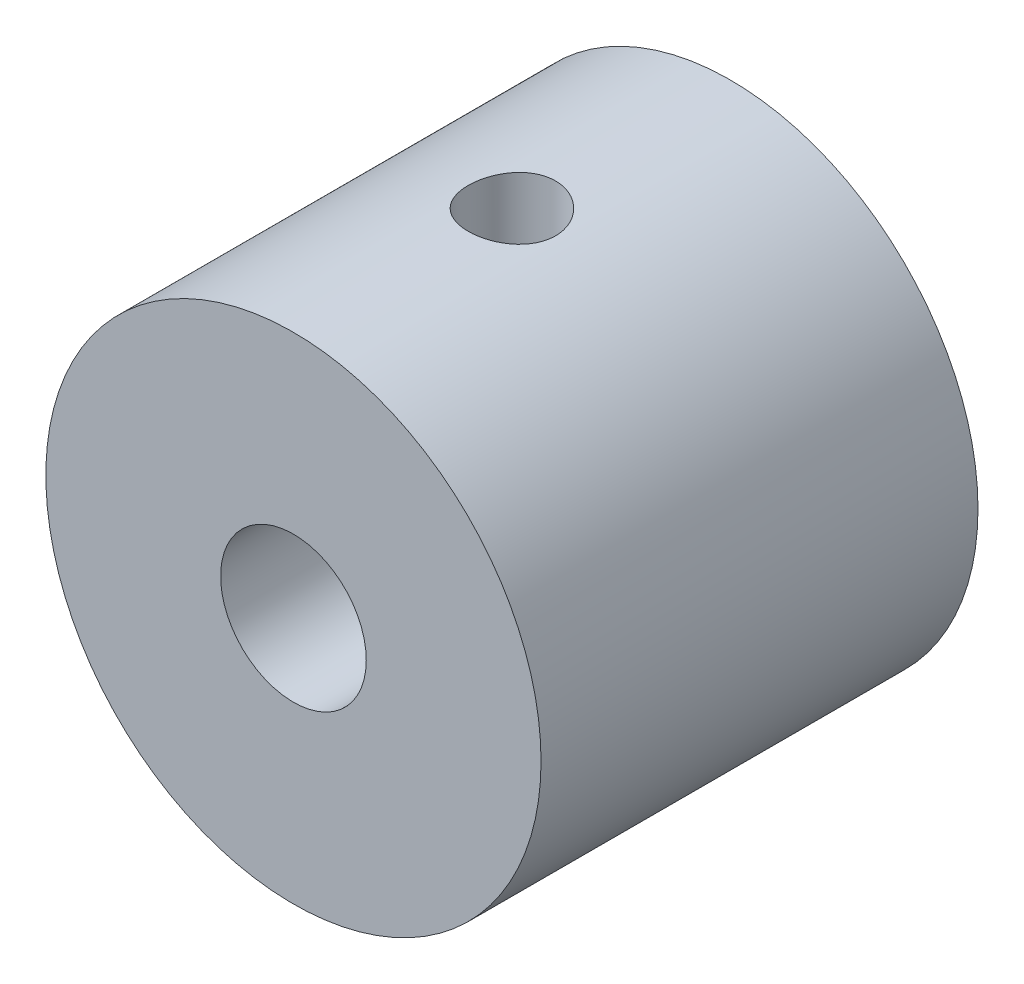
ISO-10303-21;
HEADER;
FILE_DESCRIPTION(('STEP AP214'),'2;1');
FILE_NAME('part.step','',(''),(''),'','','');
FILE_SCHEMA(('AUTOMOTIVE_DESIGN { 1 0 10303 214 1 1 1 1 }'));
ENDSEC;
DATA;
#1=APPLICATION_CONTEXT('core data for automotive mechanical design processes');
#2=APPLICATION_PROTOCOL_DEFINITION('international standard','automotive_design',2000,#1);
#3=PRODUCT_CONTEXT('',#1,'mechanical');
#4=PRODUCT('Part','Part','',(#3));
#5=PRODUCT_RELATED_PRODUCT_CATEGORY('part','',(#4));
#6=PRODUCT_DEFINITION_FORMATION('','',#4);
#7=PRODUCT_DEFINITION_CONTEXT('part definition',#1,'design');
#8=PRODUCT_DEFINITION('design','',#6,#7);
#9=PRODUCT_DEFINITION_SHAPE('','',#8);
#10=(LENGTH_UNIT() NAMED_UNIT(*) SI_UNIT(.MILLI.,.METRE.));
#11=(NAMED_UNIT(*) PLANE_ANGLE_UNIT() SI_UNIT($,.RADIAN.));
#12=(NAMED_UNIT(*) SI_UNIT($,.STERADIAN.) SOLID_ANGLE_UNIT());
#13=UNCERTAINTY_MEASURE_WITH_UNIT(LENGTH_MEASURE(1.E-05),#10,'distance_accuracy_value','');
#14=(GEOMETRIC_REPRESENTATION_CONTEXT(3) GLOBAL_UNCERTAINTY_ASSIGNED_CONTEXT((#13)) GLOBAL_UNIT_ASSIGNED_CONTEXT((#10,
#11,#12)) REPRESENTATION_CONTEXT('',''));
#15=CARTESIAN_POINT('',(0.,0.,0.));
#16=DIRECTION('',(0.,0.,1.));
#17=DIRECTION('',(1.,0.,0.));
#18=AXIS2_PLACEMENT_3D('',#15,#16,#17);
#19=CARTESIAN_POINT('',(0.,0.,15.));
#20=DIRECTION('',(0.,0.,1.));
#21=DIRECTION('',(1.,0.,0.));
#22=AXIS2_PLACEMENT_3D('',#19,#20,#21);
#23=PLANE('',#22);
#24=CARTESIAN_POINT('',(0.,0.,15.));
#25=DIRECTION('',(0.,0.,1.));
#26=DIRECTION('',(1.,0.,0.));
#27=AXIS2_PLACEMENT_3D('',#24,#25,#26);
#28=CIRCLE('',#27,8.5);
#29=CARTESIAN_POINT('',(8.5,0.,15.));
#30=VERTEX_POINT('',#29);
#31=EDGE_CURVE('E10',#30,#30,#28,.T.);
#32=ORIENTED_EDGE('',*,*,#31,.T.);
#33=EDGE_LOOP('',(#32));
#34=FACE_BOUND('',#33,.T.);
#35=CARTESIAN_POINT('',(0.,0.,15.));
#36=DIRECTION('',(0.,0.,1.));
#37=DIRECTION('',(1.,0.,0.));
#38=AXIS2_PLACEMENT_3D('',#35,#36,#37);
#39=CIRCLE('',#38,2.5);
#40=CARTESIAN_POINT('',(2.5,0.,15.));
#41=VERTEX_POINT('',#40);
#42=EDGE_CURVE('E50',#41,#41,#39,.T.);
#43=ORIENTED_EDGE('',*,*,#42,.F.);
#44=EDGE_LOOP('',(#43));
#45=FACE_BOUND('',#44,.T.);
#46=ADVANCED_FACE('F31',(#34,#45),#23,.T.);
#47=CARTESIAN_POINT('',(0.,0.,0.));
#48=DIRECTION('',(0.,0.,1.));
#49=DIRECTION('',(1.,0.,0.));
#50=AXIS2_PLACEMENT_3D('',#47,#48,#49);
#51=PLANE('',#50);
#52=CARTESIAN_POINT('',(0.,0.,0.));
#53=DIRECTION('',(0.,0.,1.));
#54=DIRECTION('',(1.,0.,0.));
#55=AXIS2_PLACEMENT_3D('',#52,#53,#54);
#56=CIRCLE('',#55,8.5);
#57=CARTESIAN_POINT('',(8.5,0.,0.));
#58=VERTEX_POINT('',#57);
#59=EDGE_CURVE('E45',#58,#58,#56,.T.);
#60=ORIENTED_EDGE('',*,*,#59,.F.);
#61=EDGE_LOOP('',(#60));
#62=FACE_BOUND('',#61,.T.);
#63=CARTESIAN_POINT('',(0.,0.,0.));
#64=DIRECTION('',(0.,0.,1.));
#65=DIRECTION('',(1.,0.,0.));
#66=AXIS2_PLACEMENT_3D('',#63,#64,#65);
#67=CIRCLE('',#66,2.5);
#68=CARTESIAN_POINT('',(2.5,0.,0.));
#69=VERTEX_POINT('',#68);
#70=EDGE_CURVE('E53',#69,#69,#67,.T.);
#71=ORIENTED_EDGE('',*,*,#70,.T.);
#72=EDGE_LOOP('',(#71));
#73=FACE_BOUND('',#72,.T.);
#74=ADVANCED_FACE('F89',(#62,#73),#51,.F.);
#75=CARTESIAN_POINT('',(0.,0.,15.));
#76=DIRECTION('',(0.,0.,-1.));
#77=DIRECTION('',(-1.,0.,0.));
#78=AXIS2_PLACEMENT_3D('',#75,#76,#77);
#79=CYLINDRICAL_SURFACE('',#78,8.5);
#80=CARTESIAN_POINT('',(0.,-8.5,9.));
#81=CARTESIAN_POINT('',(0.0835602073116834,-8.49999852465812,8.9999967178691));
#82=CARTESIAN_POINT('',(0.167164170899166,-8.49875504437695,8.99299410009958));
#83=CARTESIAN_POINT('',(0.33202220467292,-8.49391434547826,8.96518320685825));
#84=CARTESIAN_POINT('',(0.413274128543538,-8.49031504366607,8.94436271235211));
#85=CARTESIAN_POINT('',(0.571019510053261,-8.4811659180518,8.88956848670668));
#86=CARTESIAN_POINT('',(0.647516980962108,-8.47561776634704,8.85560602873436));
#87=CARTESIAN_POINT('',(0.79371930055972,-8.4631790616307,8.77552262272467));
#88=CARTESIAN_POINT('',(0.863424820850616,-8.45628864154791,8.72940287849939));
#89=CARTESIAN_POINT('',(0.994816516549547,-8.44184556474541,8.62579132915275));
#90=CARTESIAN_POINT('',(1.05641975336287,-8.43428721228608,8.56819513097525));
#91=CARTESIAN_POINT('',(1.1691412650637,-8.41940313016037,8.44349027020934));
#92=CARTESIAN_POINT('',(1.22025883768728,-8.4120774161024,8.37638097100183));
#93=CARTESIAN_POINT('',(1.31089615224234,-8.39843282674879,8.23397760532877));
#94=CARTESIAN_POINT('',(1.35033279728854,-8.39212130489153,8.15862988281188));
#95=CARTESIAN_POINT('',(1.41595715270317,-8.38129933378098,8.0022490569533));
#96=CARTESIAN_POINT('',(1.44214587005801,-8.37678874764249,7.92121638626272));
#97=CARTESIAN_POINT('',(1.48026740658905,-8.37013636121934,7.75664894310292));
#98=CARTESIAN_POINT('',(1.49234409471487,-8.36797067223513,7.67314848174711));
#99=CARTESIAN_POINT('',(1.50234505486158,-8.36618114129228,7.50528048894824));
#100=CARTESIAN_POINT('',(1.50027044993802,-8.36655709762705,7.42091302684148));
#101=CARTESIAN_POINT('',(1.48214465879202,-8.36978659532625,7.25473986745596));
#102=CARTESIAN_POINT('',(1.46625598617925,-8.37261132730482,7.17291580162267));
#103=CARTESIAN_POINT('',(1.42120852873224,-8.38037493445764,7.01311326819002));
#104=CARTESIAN_POINT('',(1.39204923880641,-8.38531389010072,6.93513494708836));
#105=CARTESIAN_POINT('',(1.32112618145376,-8.39678011228507,6.78475593979735));
#106=CARTESIAN_POINT('',(1.27929578300233,-8.40331573888177,6.71238734241572));
#107=CARTESIAN_POINT('',(1.18426514162452,-8.41723322878403,6.575634979316));
#108=CARTESIAN_POINT('',(1.13106387280683,-8.42461516841691,6.5112519348913));
#109=CARTESIAN_POINT('',(1.01392044402847,-8.43951963661095,6.39135835341984));
#110=CARTESIAN_POINT('',(0.949839043227183,-8.44704269154381,6.33598383870425));
#111=CARTESIAN_POINT('',(0.813223017047742,-8.46128697681384,6.23675182224636));
#112=CARTESIAN_POINT('',(0.74068832425797,-8.46800820075587,6.19289441235744));
#113=CARTESIAN_POINT('',(0.58909043349764,-8.47990283414647,6.11792570133133));
#114=CARTESIAN_POINT('',(0.510020681297825,-8.48507466502145,6.08682738775337));
#115=CARTESIAN_POINT('',(0.347668482380528,-8.49327535201155,6.03839100335811));
#116=CARTESIAN_POINT('',(0.264386432134316,-8.49630440940878,6.02105164007075));
#117=CARTESIAN_POINT('',(0.0971451116191689,-8.49985092576813,6.00081200141636));
#118=CARTESIAN_POINT('',(0.013209084361507,-8.50040083433622,5.99772516159403));
#119=CARTESIAN_POINT('',(-0.153980271251543,-8.49901631664242,6.00557941294352));
#120=CARTESIAN_POINT('',(-0.237233629020516,-8.49708199798832,6.01651989650209));
#121=CARTESIAN_POINT('',(-0.400111048540306,-8.49096650695861,6.05196307734012));
#122=CARTESIAN_POINT('',(-0.479756042957809,-8.48680079660993,6.07637247882884));
#123=CARTESIAN_POINT('',(-0.633823333081784,-8.47668767054273,6.13796046041181));
#124=CARTESIAN_POINT('',(-0.708245306379776,-8.47074014495488,6.17513982794151));
#125=CARTESIAN_POINT('',(-0.850557919353285,-8.45764232694309,6.2616330721365));
#126=CARTESIAN_POINT('',(-0.918377380876573,-8.45048081539685,6.31106232996766));
#127=CARTESIAN_POINT('',(-1.04482575376698,-8.43578086254215,6.42049471234006));
#128=CARTESIAN_POINT('',(-1.10345391044434,-8.42824239034875,6.48049870430486));
#129=CARTESIAN_POINT('',(-1.21055495751759,-8.41353196779635,6.61021768885172));
#130=CARTESIAN_POINT('',(-1.25890120329949,-8.40636532837837,6.68003794375939));
#131=CARTESIAN_POINT('',(-1.34317887649159,-8.39331262284436,6.82691843383291));
#132=CARTESIAN_POINT('',(-1.37911073038509,-8.38742651273966,6.90397842016974));
#133=CARTESIAN_POINT('',(-1.43735470236499,-8.37764200573802,7.06281171816086));
#134=CARTESIAN_POINT('',(-1.45972757437841,-8.3737347552807,7.14456218099255));
#135=CARTESIAN_POINT('',(-1.49040804698522,-8.36832903130758,7.31073623477485));
#136=CARTESIAN_POINT('',(-1.4987170345307,-8.36683032026719,7.39515956129642));
#137=CARTESIAN_POINT('',(-1.50099164151106,-8.36642243845549,7.5630165247977));
#138=CARTESIAN_POINT('',(-1.49515678461176,-8.36747724556747,7.64644743680322));
#139=CARTESIAN_POINT('',(-1.46974322873663,-8.37197817944576,7.81111994714207));
#140=CARTESIAN_POINT('',(-1.45016459057914,-8.37542429563017,7.89236155516174));
#141=CARTESIAN_POINT('',(-1.39789926667029,-8.38430518558531,8.05025834545232));
#142=CARTESIAN_POINT('',(-1.36523178909751,-8.38973704421377,8.12692006020943));
#143=CARTESIAN_POINT('',(-1.2877371522897,-8.40197983656061,8.27370686948198));
#144=CARTESIAN_POINT('',(-1.24290927156669,-8.40879085209956,8.34383157581883));
#145=CARTESIAN_POINT('',(-1.1416626166475,-8.42313765215559,8.47655797659853));
#146=CARTESIAN_POINT('',(-1.0850977566265,-8.43068186379938,8.53904734012171));
#147=CARTESIAN_POINT('',(-0.962289483399126,-8.44557973306429,8.65371472848376));
#148=CARTESIAN_POINT('',(-0.896043845959504,-8.45293334643561,8.70589037716824));
#149=CARTESIAN_POINT('',(-0.755134398648691,-8.46668871310451,8.79882734392791));
#150=CARTESIAN_POINT('',(-0.680408643630285,-8.47308254914894,8.83949593597092));
#151=CARTESIAN_POINT('',(-0.5251002901337,-8.4841208835999,8.90763861326231));
#152=CARTESIAN_POINT('',(-0.444523462097548,-8.48876707834471,8.93512550042316));
#153=CARTESIAN_POINT('',(-0.303055940544958,-8.49480295232011,8.97033309128865));
#154=CARTESIAN_POINT('',(-0.243008531002894,-8.49674116179219,8.98143982639593));
#155=CARTESIAN_POINT('',(-0.121981841577228,-8.4993402109253,8.99627440232578));
#156=CARTESIAN_POINT('',(-0.0610025810358461,-8.50000107706366,9.00000239609813));
#157=CARTESIAN_POINT('',(0.,-8.5,9.));
#158=B_SPLINE_CURVE_WITH_KNOTS('',3,(#80,#81,#82,#83,#84,#85,#86,#87,#88,#89,#90,#91,#92,#93,
#94,#95,#96,#97,#98,#99,#100,#101,#102,#103,#104,#105,#106,#107,#108,#109,#110,#111,#112,#113,
#114,#115,#116,#117,#118,#119,#120,#121,#122,#123,#124,#125,#126,#127,#128,#129,#130,#131,#132,
#133,#134,#135,#136,#137,#138,#139,#140,#141,#142,#143,#144,#145,#146,#147,#148,#149,#150,#151,
#152,#153,#154,#155,#156,#157),.UNSPECIFIED.,.T.,.F.,(4,2,2,2,2,2,2,2,2,2,2,2,2,2,2,2,2,2,2,2,2,
2,2,2,2,2,2,2,2,2,2,2,2,2,2,2,2,2,4),(0.,0.250457591265239,0.501136955741325,0.751601762620912,
1.0020417778349,1.25487340234721,1.50772195440904,1.76232827341925,2.01691523667498,
2.26888345171767,2.52083167063641,2.76985538403527,3.01888857629236,3.26925473797252,
3.51964349748054,3.7735186488756,4.02739582496181,4.28153078678122,4.53564187317985,
4.78641705372855,5.03718137196445,5.2862301259127,5.53529423973253,5.78679991739404,
6.0383262351567,6.29279109855223,6.54724721920708,6.80055459873066,7.05383699613265,
7.30356724592812,7.55329639063616,7.80266038647827,8.05203918055447,8.30473127243323,
8.55748151381616,8.81221395085161,9.06669849128299,9.24954720252122,9.43239212355177),.UNSPECIFIED.);
#159=CARTESIAN_POINT('',(0.,-8.5,9.));
#160=VERTEX_POINT('',#159);
#161=EDGE_CURVE('E78',#160,#160,#158,.T.);
#162=ORIENTED_EDGE('',*,*,#161,.T.);
#163=EDGE_LOOP('',(#162));
#164=FACE_BOUND('',#163,.T.);
#165=CARTESIAN_POINT('',(0.,8.5,9.));
#166=CARTESIAN_POINT('',(-0.0835602073116834,8.49999852465812,8.9999967178691));
#167=CARTESIAN_POINT('',(-0.167164170899166,8.49875504437695,8.99299410009958));
#168=CARTESIAN_POINT('',(-0.33202220467292,8.49391434547826,8.96518320685825));
#169=CARTESIAN_POINT('',(-0.413274128543538,8.49031504366607,8.94436271235211));
#170=CARTESIAN_POINT('',(-0.571019510053261,8.4811659180518,8.88956848670668));
#171=CARTESIAN_POINT('',(-0.647516980962108,8.47561776634704,8.85560602873436));
#172=CARTESIAN_POINT('',(-0.79371930055972,8.4631790616307,8.77552262272467));
#173=CARTESIAN_POINT('',(-0.863424820850616,8.45628864154791,8.72940287849939));
#174=CARTESIAN_POINT('',(-0.994816516549547,8.44184556474541,8.62579132915275));
#175=CARTESIAN_POINT('',(-1.05641975336287,8.43428721228608,8.56819513097525));
#176=CARTESIAN_POINT('',(-1.1691412650637,8.41940313016037,8.44349027020934));
#177=CARTESIAN_POINT('',(-1.22025883768728,8.4120774161024,8.37638097100183));
#178=CARTESIAN_POINT('',(-1.31089615224234,8.39843282674879,8.23397760532877));
#179=CARTESIAN_POINT('',(-1.35033279728854,8.39212130489153,8.15862988281188));
#180=CARTESIAN_POINT('',(-1.41595715270317,8.38129933378098,8.0022490569533));
#181=CARTESIAN_POINT('',(-1.44214587005801,8.37678874764249,7.92121638626272));
#182=CARTESIAN_POINT('',(-1.48026740658905,8.37013636121934,7.75664894310292));
#183=CARTESIAN_POINT('',(-1.49234409471487,8.36797067223513,7.67314848174711));
#184=CARTESIAN_POINT('',(-1.50234505486158,8.36618114129228,7.50528048894824));
#185=CARTESIAN_POINT('',(-1.50027044993802,8.36655709762705,7.42091302684148));
#186=CARTESIAN_POINT('',(-1.48214465879202,8.36978659532625,7.25473986745596));
#187=CARTESIAN_POINT('',(-1.46625598617925,8.37261132730482,7.17291580162267));
#188=CARTESIAN_POINT('',(-1.42120852873224,8.38037493445764,7.01311326819002));
#189=CARTESIAN_POINT('',(-1.39204923880641,8.38531389010072,6.93513494708836));
#190=CARTESIAN_POINT('',(-1.32112618145376,8.39678011228507,6.78475593979735));
#191=CARTESIAN_POINT('',(-1.27929578300233,8.40331573888177,6.71238734241572));
#192=CARTESIAN_POINT('',(-1.18426514162452,8.41723322878403,6.575634979316));
#193=CARTESIAN_POINT('',(-1.13106387280683,8.42461516841691,6.5112519348913));
#194=CARTESIAN_POINT('',(-1.01392044402847,8.43951963661095,6.39135835341984));
#195=CARTESIAN_POINT('',(-0.949839043227183,8.44704269154381,6.33598383870425));
#196=CARTESIAN_POINT('',(-0.813223017047742,8.46128697681384,6.23675182224636));
#197=CARTESIAN_POINT('',(-0.74068832425797,8.46800820075587,6.19289441235744));
#198=CARTESIAN_POINT('',(-0.58909043349764,8.47990283414647,6.11792570133133));
#199=CARTESIAN_POINT('',(-0.510020681297825,8.48507466502145,6.08682738775337));
#200=CARTESIAN_POINT('',(-0.347668482380528,8.49327535201155,6.03839100335811));
#201=CARTESIAN_POINT('',(-0.264386432134316,8.49630440940878,6.02105164007075));
#202=CARTESIAN_POINT('',(-0.0971451116191689,8.49985092576813,6.00081200141636));
#203=CARTESIAN_POINT('',(-0.013209084361507,8.50040083433622,5.99772516159403));
#204=CARTESIAN_POINT('',(0.153980271251543,8.49901631664242,6.00557941294352));
#205=CARTESIAN_POINT('',(0.237233629020516,8.49708199798832,6.01651989650209));
#206=CARTESIAN_POINT('',(0.400111048540306,8.49096650695861,6.05196307734012));
#207=CARTESIAN_POINT('',(0.479756042957809,8.48680079660993,6.07637247882884));
#208=CARTESIAN_POINT('',(0.633823333081784,8.47668767054273,6.13796046041181));
#209=CARTESIAN_POINT('',(0.708245306379776,8.47074014495488,6.17513982794151));
#210=CARTESIAN_POINT('',(0.850557919353285,8.45764232694309,6.2616330721365));
#211=CARTESIAN_POINT('',(0.918377380876573,8.45048081539685,6.31106232996766));
#212=CARTESIAN_POINT('',(1.04482575376698,8.43578086254215,6.42049471234006));
#213=CARTESIAN_POINT('',(1.10345391044434,8.42824239034875,6.48049870430486));
#214=CARTESIAN_POINT('',(1.21055495751759,8.41353196779635,6.61021768885172));
#215=CARTESIAN_POINT('',(1.25890120329949,8.40636532837837,6.68003794375939));
#216=CARTESIAN_POINT('',(1.34317887649159,8.39331262284436,6.82691843383291));
#217=CARTESIAN_POINT('',(1.37911073038509,8.38742651273966,6.90397842016974));
#218=CARTESIAN_POINT('',(1.43735470236499,8.37764200573802,7.06281171816086));
#219=CARTESIAN_POINT('',(1.45972757437841,8.3737347552807,7.14456218099255));
#220=CARTESIAN_POINT('',(1.49040804698522,8.36832903130758,7.31073623477485));
#221=CARTESIAN_POINT('',(1.4987170345307,8.36683032026719,7.39515956129642));
#222=CARTESIAN_POINT('',(1.50099164151106,8.36642243845549,7.5630165247977));
#223=CARTESIAN_POINT('',(1.49515678461176,8.36747724556747,7.64644743680322));
#224=CARTESIAN_POINT('',(1.46974322873663,8.37197817944576,7.81111994714207));
#225=CARTESIAN_POINT('',(1.45016459057914,8.37542429563017,7.89236155516174));
#226=CARTESIAN_POINT('',(1.39789926667029,8.38430518558531,8.05025834545232));
#227=CARTESIAN_POINT('',(1.36523178909751,8.38973704421377,8.12692006020943));
#228=CARTESIAN_POINT('',(1.2877371522897,8.40197983656061,8.27370686948198));
#229=CARTESIAN_POINT('',(1.24290927156669,8.40879085209956,8.34383157581883));
#230=CARTESIAN_POINT('',(1.1416626166475,8.42313765215559,8.47655797659853));
#231=CARTESIAN_POINT('',(1.0850977566265,8.43068186379938,8.53904734012171));
#232=CARTESIAN_POINT('',(0.962289483399126,8.44557973306429,8.65371472848376));
#233=CARTESIAN_POINT('',(0.896043845959504,8.45293334643561,8.70589037716824));
#234=CARTESIAN_POINT('',(0.755134398648691,8.46668871310451,8.79882734392791));
#235=CARTESIAN_POINT('',(0.680408643630285,8.47308254914894,8.83949593597092));
#236=CARTESIAN_POINT('',(0.5251002901337,8.4841208835999,8.90763861326231));
#237=CARTESIAN_POINT('',(0.444523462097548,8.48876707834471,8.93512550042316));
#238=CARTESIAN_POINT('',(0.303055940544958,8.49480295232011,8.97033309128865));
#239=CARTESIAN_POINT('',(0.243008531002894,8.49674116179219,8.98143982639593));
#240=CARTESIAN_POINT('',(0.121981841577228,8.4993402109253,8.99627440232578));
#241=CARTESIAN_POINT('',(0.0610025810358461,8.50000107706366,9.00000239609813));
#242=CARTESIAN_POINT('',(0.,8.5,9.));
#243=B_SPLINE_CURVE_WITH_KNOTS('',3,(#165,#166,#167,#168,#169,#170,#171,#172,#173,#174,#175,
#176,#177,#178,#179,#180,#181,#182,#183,#184,#185,#186,#187,#188,#189,#190,#191,#192,#193,#194,
#195,#196,#197,#198,#199,#200,#201,#202,#203,#204,#205,#206,#207,#208,#209,#210,#211,#212,#213,
#214,#215,#216,#217,#218,#219,#220,#221,#222,#223,#224,#225,#226,#227,#228,#229,#230,#231,#232,
#233,#234,#235,#236,#237,#238,#239,#240,#241,#242),.UNSPECIFIED.,.T.,.F.,(4,2,2,2,2,2,2,2,2,2,2,
2,2,2,2,2,2,2,2,2,2,2,2,2,2,2,2,2,2,2,2,2,2,2,2,2,2,2,4),(0.,0.250457591265239,
0.501136955741325,0.751601762620912,1.0020417778349,1.25487340234721,1.50772195440904,
1.76232827341925,2.01691523667498,2.26888345171767,2.52083167063641,2.76985538403527,
3.01888857629236,3.26925473797252,3.51964349748054,3.7735186488756,4.02739582496181,
4.28153078678122,4.53564187317985,4.78641705372855,5.03718137196445,5.2862301259127,
5.53529423973253,5.78679991739404,6.0383262351567,6.29279109855223,6.54724721920708,
6.80055459873066,7.05383699613265,7.30356724592812,7.55329639063616,7.80266038647827,
8.05203918055447,8.30473127243323,8.55748151381616,8.81221395085161,9.06669849128299,
9.24954720252122,9.43239212355177),.UNSPECIFIED.);
#244=CARTESIAN_POINT('',(0.,8.5,9.));
#245=VERTEX_POINT('',#244);
#246=EDGE_CURVE('E73',#245,#245,#243,.T.);
#247=ORIENTED_EDGE('',*,*,#246,.T.);
#248=EDGE_LOOP('',(#247));
#249=FACE_BOUND('',#248,.T.);
#250=ORIENTED_EDGE('',*,*,#31,.F.);
#251=EDGE_LOOP('',(#250));
#252=FACE_BOUND('',#251,.T.);
#253=ORIENTED_EDGE('',*,*,#59,.T.);
#254=EDGE_LOOP('',(#253));
#255=FACE_BOUND('',#254,.T.);
#256=ADVANCED_FACE('F33',(#164,#249,#252,#255),#79,.T.);
#257=CARTESIAN_POINT('',(0.,0.,15.));
#258=DIRECTION('',(0.,0.,-1.));
#259=DIRECTION('',(-1.,0.,0.));
#260=AXIS2_PLACEMENT_3D('',#257,#258,#259);
#261=CYLINDRICAL_SURFACE('',#260,2.5);
#262=CARTESIAN_POINT('',(0.,-2.5,9.));
#263=CARTESIAN_POINT('',(0.0767298334620159,-2.49999625789732,8.99999590899012));
#264=CARTESIAN_POINT('',(0.153582320644178,-2.4964290461501,8.99407132907374));
#265=CARTESIAN_POINT('',(0.304975509530679,-2.48249903608568,8.97067568048467));
#266=CARTESIAN_POINT('',(0.379510034596047,-2.47211948032719,8.95317613814578));
#267=CARTESIAN_POINT('',(0.523751827790837,-2.44561558054488,8.90761363883314));
#268=CARTESIAN_POINT('',(0.593481028226566,-2.42951973272944,8.87960304183684));
#269=CARTESIAN_POINT('',(0.727030318214658,-2.39295367626407,8.81413966685897));
#270=CARTESIAN_POINT('',(0.790851869416383,-2.37248455380255,8.77668923303125));
#271=CARTESIAN_POINT('',(0.916299278999315,-2.32705360719088,8.69022517329142));
#272=CARTESIAN_POINT('',(0.977384020081415,-2.30186792195985,8.64054630464861));
#273=CARTESIAN_POINT('',(1.09088270411891,-2.25030439279634,8.53253279617173));
#274=CARTESIAN_POINT('',(1.14328534948112,-2.22392505153571,8.47418706281268));
#275=CARTESIAN_POINT('',(1.24444996762974,-2.1691106699591,8.34207648950327));
#276=CARTESIAN_POINT('',(1.29197766378809,-2.14082017703649,8.26729822901871));
#277=CARTESIAN_POINT('',(1.37361437764896,-2.08938301412124,8.10915342675689));
#278=CARTESIAN_POINT('',(1.4077451733516,-2.06622802273938,8.02580110375243));
#279=CARTESIAN_POINT('',(1.45440601714221,-2.0335462966093,7.87340354934676));
#280=CARTESIAN_POINT('',(1.47016197246826,-2.02207883137591,7.80576400138968));
#281=CARTESIAN_POINT('',(1.49216172340475,-2.00590308295503,7.66819628416964));
#282=CARTESIAN_POINT('',(1.49841734556836,-2.00118639643759,7.59827107124551));
#283=CARTESIAN_POINT('',(1.50105508796009,-1.99920922463856,7.45798850578266));
#284=CARTESIAN_POINT('',(1.49741783408419,-2.00196337012718,7.3876305749068));
#285=CARTESIAN_POINT('',(1.48046060478828,-2.01453261443741,7.24872122457241));
#286=CARTESIAN_POINT('',(1.46713334620103,-2.02435302432226,7.18017120415255));
#287=CARTESIAN_POINT('',(1.43173921881792,-2.04953186944258,7.04746975787189));
#288=CARTESIAN_POINT('',(1.40978748666087,-2.06481711652537,6.98327294607552));
#289=CARTESIAN_POINT('',(1.35795061770837,-2.09927051350828,6.85930500907188));
#290=CARTESIAN_POINT('',(1.32806257259705,-2.11844008623465,6.79953551657607));
#291=CARTESIAN_POINT('',(1.25517983184583,-2.16255327268985,6.6750159028772));
#292=CARTESIAN_POINT('',(1.21080724397723,-2.18792043372992,6.61122190704507));
#293=CARTESIAN_POINT('',(1.11291092784003,-2.23930599764381,6.49132351633298));
#294=CARTESIAN_POINT('',(1.05937845100578,-2.26532500262149,6.43522656602349));
#295=CARTESIAN_POINT('',(0.935811834382965,-2.31935504958317,6.32438701817824));
#296=CARTESIAN_POINT('',(0.864517682704956,-2.34713836268532,6.27092269398401));
#297=CARTESIAN_POINT('',(0.712276050458999,-2.39772428433981,6.17687795280209));
#298=CARTESIAN_POINT('',(0.631333763943562,-2.42052955425515,6.13629064621005));
#299=CARTESIAN_POINT('',(0.467197585268204,-2.45730392066151,6.0720678172041));
#300=CARTESIAN_POINT('',(0.384467624173578,-2.47173957439704,6.04752464428409));
#301=CARTESIAN_POINT('',(0.215047895144638,-2.49218842813551,6.01298880259462));
#302=CARTESIAN_POINT('',(0.128363005661317,-2.49821172952738,6.00297868224642));
#303=CARTESIAN_POINT('',(-0.0337146143773982,-2.5009057037461,5.99849215232169));
#304=CARTESIAN_POINT('',(-0.10904247341872,-2.49873521714286,6.00209114491483));
#305=CARTESIAN_POINT('',(-0.257829401986062,-2.48778712087048,6.02042585307192));
#306=CARTESIAN_POINT('',(-0.331288509376107,-2.47900964518037,6.03516134280581));
#307=CARTESIAN_POINT('',(-0.472574932157614,-2.4559479244219,6.07454343281246));
#308=CARTESIAN_POINT('',(-0.540495750928485,-2.44180275662555,6.09894034907347));
#309=CARTESIAN_POINT('',(-0.671265749087264,-2.40913880862844,6.15667737636527));
#310=CARTESIAN_POINT('',(-0.73411392496391,-2.39061916586511,6.19001925134667));
#311=CARTESIAN_POINT('',(-0.860006262823865,-2.3484549623736,6.26855697920871));
#312=CARTESIAN_POINT('',(-0.922394150456838,-2.3244780273988,6.31462382907839));
#313=CARTESIAN_POINT('',(-1.03902603131014,-2.27474265574731,6.41539139348862));
#314=CARTESIAN_POINT('',(-1.09326040273738,-2.2489821658636,6.47010215485254));
#315=CARTESIAN_POINT('',(-1.19931996735579,-2.19445423909891,6.59491039003715));
#316=CARTESIAN_POINT('',(-1.24991019630915,-2.16573241746291,6.6660838854655));
#317=CARTESIAN_POINT('',(-1.33845238915668,-2.1121618206671,6.81721602456821));
#318=CARTESIAN_POINT('',(-1.37641766769781,-2.0873089799769,6.89716529389279));
#319=CARTESIAN_POINT('',(-1.43142578795776,-2.04984909240519,7.04624302230669));
#320=CARTESIAN_POINT('',(-1.4512162533619,-2.03575659328729,7.11398031235859));
#321=CARTESIAN_POINT('',(-1.48113663905972,-2.01409605743544,7.2525320780801));
#322=CARTESIAN_POINT('',(-1.49127995297631,-2.00651897642721,7.32334214432783));
#323=CARTESIAN_POINT('',(-1.50134130416631,-1.99900446616268,7.46637694759703));
#324=CARTESIAN_POINT('',(-1.50122089107869,-1.99909576445937,7.53860599068704));
#325=CARTESIAN_POINT('',(-1.49066472959328,-2.0069771789285,7.68189443560946));
#326=CARTESIAN_POINT('',(-1.48022337215759,-2.0147714813882,7.7529531800806));
#327=CARTESIAN_POINT('',(-1.45040174148913,-2.0363318524298,7.88848841757219));
#328=CARTESIAN_POINT('',(-1.43147636845351,-2.0497921180558,7.95311709430687));
#329=CARTESIAN_POINT('',(-1.38563242076993,-2.08105501960151,8.07833725447422));
#330=CARTESIAN_POINT('',(-1.35871083588479,-2.09885929040482,8.13892720696055));
#331=CARTESIAN_POINT('',(-1.29289245555733,-2.14012990550917,8.26431985722078));
#332=CARTESIAN_POINT('',(-1.25279167675753,-2.16404587582639,8.3283411038543));
#333=CARTESIAN_POINT('',(-1.16375698389085,-2.21320127030768,8.44938007261729));
#334=CARTESIAN_POINT('',(-1.11481579607798,-2.23844177205021,8.50639196215256));
#335=CARTESIAN_POINT('',(-1.00009777425734,-2.29225690291476,8.62135094913167));
#336=CARTESIAN_POINT('',(-0.932876819313905,-2.32070308663658,8.67793107489619));
#337=CARTESIAN_POINT('',(-0.78846243444559,-2.37365428872367,8.77909785586331));
#338=CARTESIAN_POINT('',(-0.711265444501541,-2.39815789310936,8.82368021198479));
#339=CARTESIAN_POINT('',(-0.551125230801454,-2.43985578654394,8.89778580757373));
#340=CARTESIAN_POINT('',(-0.468430086957214,-2.45725077479787,8.92772806492683));
#341=CARTESIAN_POINT('',(-0.297973306118808,-2.48366273001246,8.97272469521097));
#342=CARTESIAN_POINT('',(-0.210232099648613,-2.49271125871485,8.98783516785699));
#343=CARTESIAN_POINT('',(-0.101558096917537,-2.49802001168187,8.99669745470866));
#344=CARTESIAN_POINT('',(-0.0812762590282779,-2.49876114656362,8.99793441730609));
#345=CARTESIAN_POINT('',(-0.0406658206871126,-2.49975164517367,8.99958624637086));
#346=CARTESIAN_POINT('',(-0.0203372186375696,-2.50000099184316,9.0000010843209));
#347=CARTESIAN_POINT('',(0.,-2.5,9.));
#348=B_SPLINE_CURVE_WITH_KNOTS('',3,(#262,#263,#264,#265,#266,#267,#268,#269,#270,#271,#272,
#273,#274,#275,#276,#277,#278,#279,#280,#281,#282,#283,#284,#285,#286,#287,#288,#289,#290,#291,
#292,#293,#294,#295,#296,#297,#298,#299,#300,#301,#302,#303,#304,#305,#306,#307,#308,#309,#310,
#311,#312,#313,#314,#315,#316,#317,#318,#319,#320,#321,#322,#323,#324,#325,#326,#327,#328,#329,
#330,#331,#332,#333,#334,#335,#336,#337,#338,#339,#340,#341,#342,#343,#344,#345,#346,#347),
.UNSPECIFIED.,.T.,.F.,(4,2,2,2,2,2,2,2,2,2,2,2,2,2,2,2,2,2,2,2,2,2,2,2,2,2,2,2,2,2,2,2,2,2,2,2,
2,2,2,2,2,2,4),(0.,0.230102237548649,0.460772627520012,0.690308884600012,0.919788197992274,
1.16681590732473,1.414162579348,1.69183813189807,1.96906040692092,2.17933829855633,
2.38935420916578,2.59978170870726,2.81036753273872,3.01823267593207,3.22617409809868,
3.47046995225163,3.71500044803674,3.99360957884691,4.27206939275324,4.5329679069656,
4.79355286918236,5.01875602722426,5.24395461863455,5.46367785689772,5.68344445659025,
5.92601365818362,6.16886690081836,6.44336762428009,6.71757792616456,6.93257787314692,
7.14727888733319,7.36278425777433,7.57840681155725,7.78364098331142,7.98895251523034,
8.22578610052286,8.46281544370207,8.73854311775518,9.01436946031985,9.28175654462677,
9.54812832184448,9.60911473335177,9.6701032602764),.UNSPECIFIED.);
#349=CARTESIAN_POINT('',(0.,-2.5,9.));
#350=VERTEX_POINT('',#349);
#351=EDGE_CURVE('E36',#350,#350,#348,.T.);
#352=ORIENTED_EDGE('',*,*,#351,.F.);
#353=EDGE_LOOP('',(#352));
#354=FACE_BOUND('',#353,.T.);
#355=CARTESIAN_POINT('',(0.,2.5,9.));
#356=CARTESIAN_POINT('',(-0.0767298334620159,2.49999625789732,8.99999590899012));
#357=CARTESIAN_POINT('',(-0.153582320644178,2.4964290461501,8.99407132907374));
#358=CARTESIAN_POINT('',(-0.304975509530679,2.48249903608568,8.97067568048467));
#359=CARTESIAN_POINT('',(-0.379510034596047,2.47211948032719,8.95317613814578));
#360=CARTESIAN_POINT('',(-0.523751827790837,2.44561558054488,8.90761363883314));
#361=CARTESIAN_POINT('',(-0.593481028226566,2.42951973272944,8.87960304183684));
#362=CARTESIAN_POINT('',(-0.727030318214658,2.39295367626407,8.81413966685897));
#363=CARTESIAN_POINT('',(-0.790851869416383,2.37248455380255,8.77668923303125));
#364=CARTESIAN_POINT('',(-0.916299278999315,2.32705360719088,8.69022517329142));
#365=CARTESIAN_POINT('',(-0.977384020081415,2.30186792195985,8.64054630464861));
#366=CARTESIAN_POINT('',(-1.09088270411891,2.25030439279634,8.53253279617173));
#367=CARTESIAN_POINT('',(-1.14328534948112,2.22392505153571,8.47418706281268));
#368=CARTESIAN_POINT('',(-1.24444996762974,2.1691106699591,8.34207648950327));
#369=CARTESIAN_POINT('',(-1.29197766378809,2.14082017703649,8.26729822901871));
#370=CARTESIAN_POINT('',(-1.37361437764896,2.08938301412124,8.10915342675689));
#371=CARTESIAN_POINT('',(-1.4077451733516,2.06622802273938,8.02580110375243));
#372=CARTESIAN_POINT('',(-1.45440601714221,2.0335462966093,7.87340354934676));
#373=CARTESIAN_POINT('',(-1.47016197246826,2.02207883137591,7.80576400138968));
#374=CARTESIAN_POINT('',(-1.49216172340475,2.00590308295503,7.66819628416964));
#375=CARTESIAN_POINT('',(-1.49841734556836,2.00118639643759,7.59827107124551));
#376=CARTESIAN_POINT('',(-1.50105508796009,1.99920922463856,7.45798850578266));
#377=CARTESIAN_POINT('',(-1.49741783408419,2.00196337012718,7.3876305749068));
#378=CARTESIAN_POINT('',(-1.48046060478828,2.01453261443741,7.24872122457241));
#379=CARTESIAN_POINT('',(-1.46713334620103,2.02435302432226,7.18017120415255));
#380=CARTESIAN_POINT('',(-1.43173921881792,2.04953186944258,7.04746975787189));
#381=CARTESIAN_POINT('',(-1.40978748666087,2.06481711652537,6.98327294607552));
#382=CARTESIAN_POINT('',(-1.35795061770837,2.09927051350828,6.85930500907188));
#383=CARTESIAN_POINT('',(-1.32806257259705,2.11844008623465,6.79953551657607));
#384=CARTESIAN_POINT('',(-1.25517983184583,2.16255327268985,6.6750159028772));
#385=CARTESIAN_POINT('',(-1.21080724397723,2.18792043372992,6.61122190704507));
#386=CARTESIAN_POINT('',(-1.11291092784003,2.23930599764381,6.49132351633298));
#387=CARTESIAN_POINT('',(-1.05937845100578,2.26532500262149,6.43522656602349));
#388=CARTESIAN_POINT('',(-0.935811834382965,2.31935504958317,6.32438701817824));
#389=CARTESIAN_POINT('',(-0.864517682704956,2.34713836268532,6.27092269398401));
#390=CARTESIAN_POINT('',(-0.712276050458999,2.39772428433981,6.17687795280209));
#391=CARTESIAN_POINT('',(-0.631333763943562,2.42052955425515,6.13629064621005));
#392=CARTESIAN_POINT('',(-0.467197585268204,2.45730392066151,6.0720678172041));
#393=CARTESIAN_POINT('',(-0.384467624173578,2.47173957439704,6.04752464428409));
#394=CARTESIAN_POINT('',(-0.215047895144638,2.49218842813551,6.01298880259462));
#395=CARTESIAN_POINT('',(-0.128363005661317,2.49821172952738,6.00297868224642));
#396=CARTESIAN_POINT('',(0.0337146143773982,2.5009057037461,5.99849215232169));
#397=CARTESIAN_POINT('',(0.10904247341872,2.49873521714286,6.00209114491483));
#398=CARTESIAN_POINT('',(0.257829401986062,2.48778712087048,6.02042585307192));
#399=CARTESIAN_POINT('',(0.331288509376107,2.47900964518037,6.03516134280581));
#400=CARTESIAN_POINT('',(0.472574932157614,2.4559479244219,6.07454343281246));
#401=CARTESIAN_POINT('',(0.540495750928485,2.44180275662555,6.09894034907347));
#402=CARTESIAN_POINT('',(0.671265749087264,2.40913880862844,6.15667737636527));
#403=CARTESIAN_POINT('',(0.73411392496391,2.39061916586511,6.19001925134667));
#404=CARTESIAN_POINT('',(0.860006262823865,2.3484549623736,6.26855697920871));
#405=CARTESIAN_POINT('',(0.922394150456838,2.3244780273988,6.31462382907839));
#406=CARTESIAN_POINT('',(1.03902603131014,2.27474265574731,6.41539139348862));
#407=CARTESIAN_POINT('',(1.09326040273738,2.2489821658636,6.47010215485254));
#408=CARTESIAN_POINT('',(1.19931996735579,2.19445423909891,6.59491039003715));
#409=CARTESIAN_POINT('',(1.24991019630915,2.16573241746291,6.6660838854655));
#410=CARTESIAN_POINT('',(1.33845238915668,2.1121618206671,6.81721602456821));
#411=CARTESIAN_POINT('',(1.37641766769781,2.0873089799769,6.89716529389279));
#412=CARTESIAN_POINT('',(1.43142578795776,2.04984909240519,7.04624302230669));
#413=CARTESIAN_POINT('',(1.4512162533619,2.03575659328729,7.11398031235859));
#414=CARTESIAN_POINT('',(1.48113663905972,2.01409605743544,7.2525320780801));
#415=CARTESIAN_POINT('',(1.49127995297631,2.00651897642721,7.32334214432783));
#416=CARTESIAN_POINT('',(1.50134130416631,1.99900446616268,7.46637694759703));
#417=CARTESIAN_POINT('',(1.50122089107869,1.99909576445937,7.53860599068704));
#418=CARTESIAN_POINT('',(1.49066472959328,2.0069771789285,7.68189443560946));
#419=CARTESIAN_POINT('',(1.48022337215759,2.0147714813882,7.7529531800806));
#420=CARTESIAN_POINT('',(1.45040174148913,2.0363318524298,7.88848841757219));
#421=CARTESIAN_POINT('',(1.43147636845351,2.0497921180558,7.95311709430687));
#422=CARTESIAN_POINT('',(1.38563242076993,2.08105501960151,8.07833725447422));
#423=CARTESIAN_POINT('',(1.35871083588479,2.09885929040482,8.13892720696055));
#424=CARTESIAN_POINT('',(1.29289245555733,2.14012990550917,8.26431985722078));
#425=CARTESIAN_POINT('',(1.25279167675753,2.16404587582639,8.3283411038543));
#426=CARTESIAN_POINT('',(1.16375698389085,2.21320127030768,8.44938007261729));
#427=CARTESIAN_POINT('',(1.11481579607798,2.23844177205021,8.50639196215256));
#428=CARTESIAN_POINT('',(1.00009777425734,2.29225690291476,8.62135094913167));
#429=CARTESIAN_POINT('',(0.932876819313905,2.32070308663658,8.67793107489619));
#430=CARTESIAN_POINT('',(0.78846243444559,2.37365428872367,8.77909785586331));
#431=CARTESIAN_POINT('',(0.711265444501541,2.39815789310936,8.82368021198479));
#432=CARTESIAN_POINT('',(0.551125230801454,2.43985578654394,8.89778580757373));
#433=CARTESIAN_POINT('',(0.468430086957214,2.45725077479787,8.92772806492683));
#434=CARTESIAN_POINT('',(0.297973306118808,2.48366273001246,8.97272469521097));
#435=CARTESIAN_POINT('',(0.210232099648613,2.49271125871485,8.98783516785699));
#436=CARTESIAN_POINT('',(0.101558096917537,2.49802001168187,8.99669745470866));
#437=CARTESIAN_POINT('',(0.0812762590282779,2.49876114656362,8.99793441730609));
#438=CARTESIAN_POINT('',(0.0406658206871126,2.49975164517367,8.99958624637086));
#439=CARTESIAN_POINT('',(0.0203372186375696,2.50000099184316,9.0000010843209));
#440=CARTESIAN_POINT('',(0.,2.5,9.));
#441=B_SPLINE_CURVE_WITH_KNOTS('',3,(#355,#356,#357,#358,#359,#360,#361,#362,#363,#364,#365,
#366,#367,#368,#369,#370,#371,#372,#373,#374,#375,#376,#377,#378,#379,#380,#381,#382,#383,#384,
#385,#386,#387,#388,#389,#390,#391,#392,#393,#394,#395,#396,#397,#398,#399,#400,#401,#402,#403,
#404,#405,#406,#407,#408,#409,#410,#411,#412,#413,#414,#415,#416,#417,#418,#419,#420,#421,#422,
#423,#424,#425,#426,#427,#428,#429,#430,#431,#432,#433,#434,#435,#436,#437,#438,#439,#440),
.UNSPECIFIED.,.T.,.F.,(4,2,2,2,2,2,2,2,2,2,2,2,2,2,2,2,2,2,2,2,2,2,2,2,2,2,2,2,2,2,2,2,2,2,2,2,
2,2,2,2,2,2,4),(0.,0.230102237548649,0.460772627520012,0.690308884600012,0.919788197992274,
1.16681590732473,1.414162579348,1.69183813189807,1.96906040692092,2.17933829855633,
2.38935420916578,2.59978170870726,2.81036753273872,3.01823267593207,3.22617409809868,
3.47046995225163,3.71500044803674,3.99360957884691,4.27206939275324,4.5329679069656,
4.79355286918236,5.01875602722426,5.24395461863455,5.46367785689772,5.68344445659025,
5.92601365818362,6.16886690081836,6.44336762428009,6.71757792616456,6.93257787314692,
7.14727888733319,7.36278425777433,7.57840681155725,7.78364098331142,7.98895251523034,
8.22578610052286,8.46281544370207,8.73854311775518,9.01436946031985,9.28175654462677,
9.54812832184448,9.60911473335177,9.6701032602764),.UNSPECIFIED.);
#442=CARTESIAN_POINT('',(0.,2.5,9.));
#443=VERTEX_POINT('',#442);
#444=EDGE_CURVE('E55',#443,#443,#441,.T.);
#445=ORIENTED_EDGE('',*,*,#444,.F.);
#446=EDGE_LOOP('',(#445));
#447=FACE_BOUND('',#446,.T.);
#448=ORIENTED_EDGE('',*,*,#42,.T.);
#449=EDGE_LOOP('',(#448));
#450=FACE_BOUND('',#449,.T.);
#451=ORIENTED_EDGE('',*,*,#70,.F.);
#452=EDGE_LOOP('',(#451));
#453=FACE_BOUND('',#452,.T.);
#454=ADVANCED_FACE('F60',(#354,#447,#450,#453),#261,.F.);
#455=CARTESIAN_POINT('',(0.,-8.5,7.5));
#456=DIRECTION('',(0.,1.,0.));
#457=DIRECTION('',(0.,0.,1.));
#458=AXIS2_PLACEMENT_3D('',#455,#456,#457);
#459=CYLINDRICAL_SURFACE('',#458,1.5);
#460=ORIENTED_EDGE('',*,*,#444,.T.);
#461=EDGE_LOOP('',(#460));
#462=FACE_BOUND('',#461,.T.);
#463=ORIENTED_EDGE('',*,*,#246,.F.);
#464=EDGE_LOOP('',(#463));
#465=FACE_BOUND('',#464,.T.);
#466=ADVANCED_FACE('F66',(#462,#465),#459,.F.);
#467=ORIENTED_EDGE('',*,*,#351,.T.);
#468=EDGE_LOOP('',(#467));
#469=FACE_BOUND('',#468,.T.);
#470=ORIENTED_EDGE('',*,*,#161,.F.);
#471=EDGE_LOOP('',(#470));
#472=FACE_BOUND('',#471,.T.);
#473=ADVANCED_FACE('F63',(#469,#472),#459,.F.);
#474=CLOSED_SHELL('',(#46,#74,#256,#454,#466,#473));
#475=MANIFOLD_SOLID_BREP('B2',#474);
#476=ADVANCED_BREP_SHAPE_REPRESENTATION('',(#18,#475),#14);
#477=SHAPE_DEFINITION_REPRESENTATION(#9,#476);
ENDSEC;
END-ISO-10303-21;
